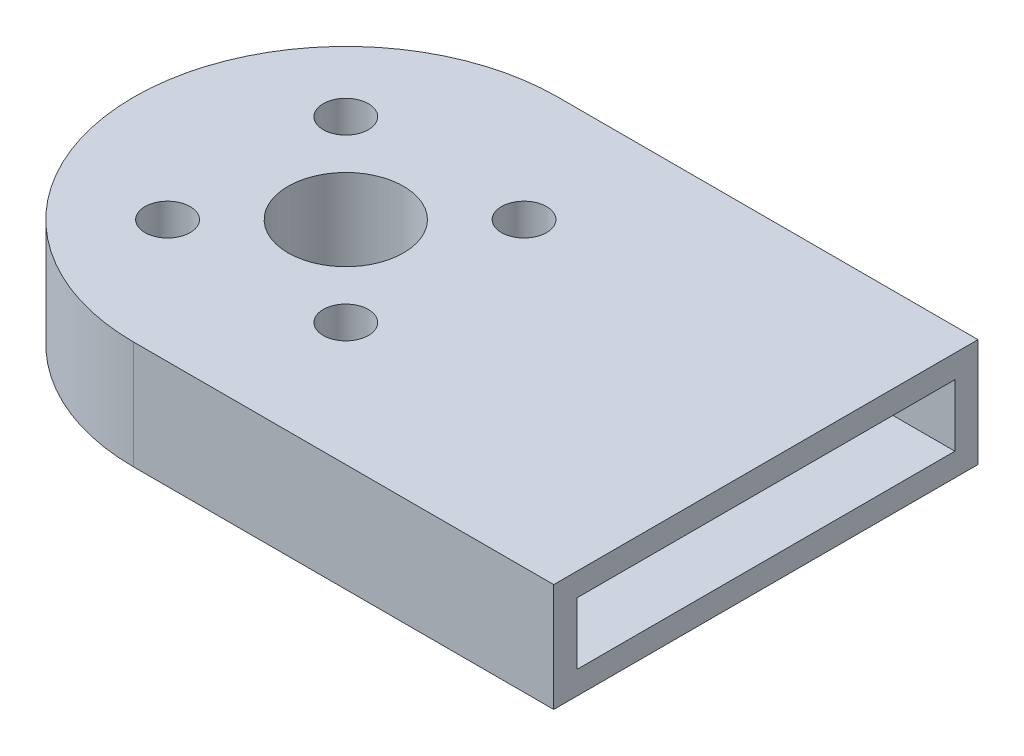
ISO-10303-21;
HEADER;
FILE_DESCRIPTION(('STEP AP214'),'2;1');
FILE_NAME('part.step','',(''),(''),'','','');
FILE_SCHEMA(('AUTOMOTIVE_DESIGN { 1 0 10303 214 1 1 1 1 }'));
ENDSEC;
DATA;
#1=APPLICATION_CONTEXT('core data for automotive mechanical design processes');
#2=APPLICATION_PROTOCOL_DEFINITION('international standard','automotive_design',2000,#1);
#3=PRODUCT_CONTEXT('',#1,'mechanical');
#4=PRODUCT('Part','Part','',(#3));
#5=PRODUCT_RELATED_PRODUCT_CATEGORY('part','',(#4));
#6=PRODUCT_DEFINITION_FORMATION('','',#4);
#7=PRODUCT_DEFINITION_CONTEXT('part definition',#1,'design');
#8=PRODUCT_DEFINITION('design','',#6,#7);
#9=PRODUCT_DEFINITION_SHAPE('','',#8);
#10=(LENGTH_UNIT() NAMED_UNIT(*) SI_UNIT(.MILLI.,.METRE.));
#11=(NAMED_UNIT(*) PLANE_ANGLE_UNIT() SI_UNIT($,.RADIAN.));
#12=(NAMED_UNIT(*) SI_UNIT($,.STERADIAN.) SOLID_ANGLE_UNIT());
#13=UNCERTAINTY_MEASURE_WITH_UNIT(LENGTH_MEASURE(1.E-05),#10,'distance_accuracy_value','');
#14=(GEOMETRIC_REPRESENTATION_CONTEXT(3) GLOBAL_UNCERTAINTY_ASSIGNED_CONTEXT((#13)) GLOBAL_UNIT_ASSIGNED_CONTEXT((#10,
#11,#12)) REPRESENTATION_CONTEXT('',''));
#15=CARTESIAN_POINT('',(0.,0.,0.));
#16=DIRECTION('',(0.,0.,1.));
#17=DIRECTION('',(1.,0.,0.));
#18=AXIS2_PLACEMENT_3D('',#15,#16,#17);
#19=CARTESIAN_POINT('',(20.,5.15,-10.1));
#20=DIRECTION('',(-1.,0.,0.));
#21=DIRECTION('',(0.,0.,1.));
#22=AXIS2_PLACEMENT_3D('',#19,#20,#21);
#23=PLANE('',#22);
#24=DIRECTION('',(0.,0.,-1.));
#25=VECTOR('',#24,1.);
#26=CARTESIAN_POINT('',(20.,0.,-10.1));
#27=LINE('',#26,#25);
#28=CARTESIAN_POINT('',(20.,0.,10.1));
#29=VERTEX_POINT('',#28);
#30=CARTESIAN_POINT('',(20.,0.,-10.1));
#31=VERTEX_POINT('',#30);
#32=EDGE_CURVE('E328',#29,#31,#27,.T.);
#33=ORIENTED_EDGE('',*,*,#32,.T.);
#34=DIRECTION('',(0.,-1.,0.));
#35=VECTOR('',#34,1.);
#36=CARTESIAN_POINT('',(20.,5.15,-10.1));
#37=LINE('',#36,#35);
#38=CARTESIAN_POINT('',(20.,5.15,-10.1));
#39=VERTEX_POINT('',#38);
#40=EDGE_CURVE('E335',#39,#31,#37,.T.);
#41=ORIENTED_EDGE('',*,*,#40,.F.);
#42=DIRECTION('',(0.,0.,-1.));
#43=VECTOR('',#42,1.);
#44=CARTESIAN_POINT('',(20.,5.15,-10.1));
#45=LINE('',#44,#43);
#46=CARTESIAN_POINT('',(20.,5.15,10.1));
#47=VERTEX_POINT('',#46);
#48=EDGE_CURVE('E316',#47,#39,#45,.T.);
#49=ORIENTED_EDGE('',*,*,#48,.F.);
#50=DIRECTION('',(0.,-1.,0.));
#51=VECTOR('',#50,1.);
#52=CARTESIAN_POINT('',(20.,5.15,10.1));
#53=LINE('',#52,#51);
#54=EDGE_CURVE('E54',#47,#29,#53,.T.);
#55=ORIENTED_EDGE('',*,*,#54,.T.);
#56=EDGE_LOOP('',(#33,#41,#49,#55));
#57=FACE_BOUND('',#56,.T.);
#58=DIRECTION('',(0.,0.,-1.));
#59=VECTOR('',#58,1.);
#60=CARTESIAN_POINT('',(20.,1.1,-10.1));
#61=LINE('',#60,#59);
#62=CARTESIAN_POINT('',(20.,1.1,9.));
#63=VERTEX_POINT('',#62);
#64=CARTESIAN_POINT('',(20.,1.1,-9.));
#65=VERTEX_POINT('',#64);
#66=EDGE_CURVE('E211',#63,#65,#61,.T.);
#67=ORIENTED_EDGE('',*,*,#66,.F.);
#68=DIRECTION('',(0.,-1.,0.));
#69=VECTOR('',#68,1.);
#70=CARTESIAN_POINT('',(20.,5.15,9.));
#71=LINE('',#70,#69);
#72=CARTESIAN_POINT('',(20.,4.05,9.));
#73=VERTEX_POINT('',#72);
#74=EDGE_CURVE('E194',#73,#63,#71,.T.);
#75=ORIENTED_EDGE('',*,*,#74,.F.);
#76=DIRECTION('',(0.,0.,-1.));
#77=VECTOR('',#76,1.);
#78=CARTESIAN_POINT('',(20.,4.05,-10.1));
#79=LINE('',#78,#77);
#80=CARTESIAN_POINT('',(20.,4.05,-9.));
#81=VERTEX_POINT('',#80);
#82=EDGE_CURVE('E61',#73,#81,#79,.T.);
#83=ORIENTED_EDGE('',*,*,#82,.T.);
#84=DIRECTION('',(0.,-1.,0.));
#85=VECTOR('',#84,1.);
#86=CARTESIAN_POINT('',(20.,5.15,-9.));
#87=LINE('',#86,#85);
#88=EDGE_CURVE('E200',#81,#65,#87,.T.);
#89=ORIENTED_EDGE('',*,*,#88,.T.);
#90=EDGE_LOOP('',(#67,#75,#83,#89));
#91=FACE_BOUND('',#90,.T.);
#92=ADVANCED_FACE('F45',(#57,#91),#23,.F.);
#93=CARTESIAN_POINT('',(0.,5.15,0.));
#94=DIRECTION('',(0.,1.,0.));
#95=DIRECTION('',(0.,0.,1.));
#96=AXIS2_PLACEMENT_3D('',#93,#94,#95);
#97=PLANE('',#96);
#98=CARTESIAN_POINT('',(4.2426406871193,5.15,4.24264068711927));
#99=DIRECTION('',(0.,1.,0.));
#100=DIRECTION('',(0.,0.,1.));
#101=AXIS2_PLACEMENT_3D('',#98,#99,#100);
#102=CIRCLE('',#101,1.075);
#103=CARTESIAN_POINT('',(4.2426406871193,5.15,5.31764068711928));
#104=VERTEX_POINT('',#103);
#105=EDGE_CURVE('E279',#104,#104,#102,.T.);
#106=ORIENTED_EDGE('',*,*,#105,.F.);
#107=EDGE_LOOP('',(#106));
#108=FACE_BOUND('',#107,.T.);
#109=CARTESIAN_POINT('',(4.24264068711929,5.15,-4.24264068711928));
#110=DIRECTION('',(0.,1.,0.));
#111=DIRECTION('',(0.,0.,1.));
#112=AXIS2_PLACEMENT_3D('',#109,#110,#111);
#113=CIRCLE('',#112,1.075);
#114=CARTESIAN_POINT('',(4.24264068711929,5.15,-3.16764068711928));
#115=VERTEX_POINT('',#114);
#116=EDGE_CURVE('E295',#115,#115,#113,.T.);
#117=ORIENTED_EDGE('',*,*,#116,.F.);
#118=EDGE_LOOP('',(#117));
#119=FACE_BOUND('',#118,.T.);
#120=CARTESIAN_POINT('',(0.,5.15,0.));
#121=DIRECTION('',(0.,1.,0.));
#122=DIRECTION('',(0.,0.,1.));
#123=AXIS2_PLACEMENT_3D('',#120,#121,#122);
#124=CIRCLE('',#123,10.1);
#125=CARTESIAN_POINT('',(0.,5.15,-10.1));
#126=VERTEX_POINT('',#125);
#127=CARTESIAN_POINT('',(0.,5.15,10.1));
#128=VERTEX_POINT('',#127);
#129=EDGE_CURVE('E311',#126,#128,#124,.T.);
#130=ORIENTED_EDGE('',*,*,#129,.T.);
#131=DIRECTION('',(1.,0.,0.));
#132=VECTOR('',#131,1.);
#133=CARTESIAN_POINT('',(20.,5.15,10.1));
#134=LINE('',#133,#132);
#135=EDGE_CURVE('E98',#128,#47,#134,.T.);
#136=ORIENTED_EDGE('',*,*,#135,.T.);
#137=ORIENTED_EDGE('',*,*,#48,.T.);
#138=DIRECTION('',(-1.,0.,0.));
#139=VECTOR('',#138,1.);
#140=CARTESIAN_POINT('',(0.,5.15,-10.1));
#141=LINE('',#140,#139);
#142=EDGE_CURVE('E70',#39,#126,#141,.T.);
#143=ORIENTED_EDGE('',*,*,#142,.T.);
#144=EDGE_LOOP('',(#130,#136,#137,#143));
#145=FACE_BOUND('',#144,.T.);
#146=CARTESIAN_POINT('',(-4.24264068711929,5.15,-4.24264068711928));
#147=DIRECTION('',(0.,1.,0.));
#148=DIRECTION('',(0.,0.,1.));
#149=AXIS2_PLACEMENT_3D('',#146,#147,#148);
#150=CIRCLE('',#149,1.075);
#151=CARTESIAN_POINT('',(-4.24264068711929,5.15,-3.16764068711928));
#152=VERTEX_POINT('',#151);
#153=EDGE_CURVE('E303',#152,#152,#150,.T.);
#154=ORIENTED_EDGE('',*,*,#153,.F.);
#155=EDGE_LOOP('',(#154));
#156=FACE_BOUND('',#155,.T.);
#157=CARTESIAN_POINT('',(-4.24264068711929,5.15,4.24264068711928));
#158=DIRECTION('',(0.,1.,0.));
#159=DIRECTION('',(0.,0.,1.));
#160=AXIS2_PLACEMENT_3D('',#157,#158,#159);
#161=CIRCLE('',#160,1.075);
#162=CARTESIAN_POINT('',(-4.24264068711929,5.15,5.31764068711928));
#163=VERTEX_POINT('',#162);
#164=EDGE_CURVE('E287',#163,#163,#161,.T.);
#165=ORIENTED_EDGE('',*,*,#164,.F.);
#166=EDGE_LOOP('',(#165));
#167=FACE_BOUND('',#166,.T.);
#168=CARTESIAN_POINT('',(0.,5.15,0.));
#169=DIRECTION('',(0.,1.,0.));
#170=DIRECTION('',(0.,0.,1.));
#171=AXIS2_PLACEMENT_3D('',#168,#169,#170);
#172=CIRCLE('',#171,2.75);
#173=CARTESIAN_POINT('',(0.,5.15,2.75));
#174=VERTEX_POINT('',#173);
#175=EDGE_CURVE('E271',#174,#174,#172,.T.);
#176=ORIENTED_EDGE('',*,*,#175,.F.);
#177=EDGE_LOOP('',(#176));
#178=FACE_BOUND('',#177,.T.);
#179=ADVANCED_FACE('F366',(#108,#119,#145,#156,#167,#178),#97,.T.);
#180=CARTESIAN_POINT('',(0.,0.,0.));
#181=DIRECTION('',(0.,1.,0.));
#182=DIRECTION('',(0.,0.,1.));
#183=AXIS2_PLACEMENT_3D('',#180,#181,#182);
#184=PLANE('',#183);
#185=CARTESIAN_POINT('',(0.,0.,0.));
#186=DIRECTION('',(0.,1.,0.));
#187=DIRECTION('',(0.,0.,1.));
#188=AXIS2_PLACEMENT_3D('',#185,#186,#187);
#189=CIRCLE('',#188,10.1);
#190=CARTESIAN_POINT('',(0.,0.,-10.1));
#191=VERTEX_POINT('',#190);
#192=CARTESIAN_POINT('',(0.,0.,10.1));
#193=VERTEX_POINT('',#192);
#194=EDGE_CURVE('E307',#191,#193,#189,.T.);
#195=ORIENTED_EDGE('',*,*,#194,.F.);
#196=DIRECTION('',(-1.,0.,0.));
#197=VECTOR('',#196,1.);
#198=CARTESIAN_POINT('',(0.,0.,-10.1));
#199=LINE('',#198,#197);
#200=EDGE_CURVE('E91',#31,#191,#199,.T.);
#201=ORIENTED_EDGE('',*,*,#200,.F.);
#202=ORIENTED_EDGE('',*,*,#32,.F.);
#203=DIRECTION('',(1.,0.,0.));
#204=VECTOR('',#203,1.);
#205=CARTESIAN_POINT('',(20.,0.,10.1));
#206=LINE('',#205,#204);
#207=EDGE_CURVE('E325',#193,#29,#206,.T.);
#208=ORIENTED_EDGE('',*,*,#207,.F.);
#209=EDGE_LOOP('',(#195,#201,#202,#208));
#210=FACE_BOUND('',#209,.T.);
#211=CARTESIAN_POINT('',(-4.24264068711929,0.,-4.24264068711928));
#212=DIRECTION('',(0.,1.,0.));
#213=DIRECTION('',(0.,0.,1.));
#214=AXIS2_PLACEMENT_3D('',#211,#212,#213);
#215=CIRCLE('',#214,1.075);
#216=CARTESIAN_POINT('',(-4.24264068711929,0.,-3.16764068711928));
#217=VERTEX_POINT('',#216);
#218=EDGE_CURVE('E299',#217,#217,#215,.T.);
#219=ORIENTED_EDGE('',*,*,#218,.T.);
#220=EDGE_LOOP('',(#219));
#221=FACE_BOUND('',#220,.T.);
#222=CARTESIAN_POINT('',(4.24264068711929,0.,-4.24264068711928));
#223=DIRECTION('',(0.,1.,0.));
#224=DIRECTION('',(0.,0.,1.));
#225=AXIS2_PLACEMENT_3D('',#222,#223,#224);
#226=CIRCLE('',#225,1.075);
#227=CARTESIAN_POINT('',(4.24264068711929,0.,-3.16764068711928));
#228=VERTEX_POINT('',#227);
#229=EDGE_CURVE('E291',#228,#228,#226,.T.);
#230=ORIENTED_EDGE('',*,*,#229,.T.);
#231=EDGE_LOOP('',(#230));
#232=FACE_BOUND('',#231,.T.);
#233=CARTESIAN_POINT('',(-4.24264068711929,0.,4.24264068711928));
#234=DIRECTION('',(0.,1.,0.));
#235=DIRECTION('',(0.,0.,1.));
#236=AXIS2_PLACEMENT_3D('',#233,#234,#235);
#237=CIRCLE('',#236,1.075);
#238=CARTESIAN_POINT('',(-4.24264068711929,0.,5.31764068711928));
#239=VERTEX_POINT('',#238);
#240=EDGE_CURVE('E283',#239,#239,#237,.T.);
#241=ORIENTED_EDGE('',*,*,#240,.T.);
#242=EDGE_LOOP('',(#241));
#243=FACE_BOUND('',#242,.T.);
#244=CARTESIAN_POINT('',(4.2426406871193,0.,4.24264068711927));
#245=DIRECTION('',(0.,1.,0.));
#246=DIRECTION('',(0.,0.,1.));
#247=AXIS2_PLACEMENT_3D('',#244,#245,#246);
#248=CIRCLE('',#247,1.075);
#249=CARTESIAN_POINT('',(4.2426406871193,0.,5.31764068711928));
#250=VERTEX_POINT('',#249);
#251=EDGE_CURVE('E275',#250,#250,#248,.T.);
#252=ORIENTED_EDGE('',*,*,#251,.T.);
#253=EDGE_LOOP('',(#252));
#254=FACE_BOUND('',#253,.T.);
#255=CARTESIAN_POINT('',(0.,0.,0.));
#256=DIRECTION('',(0.,1.,0.));
#257=DIRECTION('',(0.,0.,1.));
#258=AXIS2_PLACEMENT_3D('',#255,#256,#257);
#259=CIRCLE('',#258,2.75);
#260=CARTESIAN_POINT('',(0.,0.,2.75));
#261=VERTEX_POINT('',#260);
#262=EDGE_CURVE('E270',#261,#261,#259,.T.);
#263=ORIENTED_EDGE('',*,*,#262,.T.);
#264=EDGE_LOOP('',(#263));
#265=FACE_BOUND('',#264,.T.);
#266=ADVANCED_FACE('F346',(#210,#221,#232,#243,#254,#265),#184,.F.);
#267=CARTESIAN_POINT('',(0.,5.15,0.));
#268=DIRECTION('',(0.,-1.,0.));
#269=DIRECTION('',(0.,0.,-1.));
#270=AXIS2_PLACEMENT_3D('',#267,#268,#269);
#271=CYLINDRICAL_SURFACE('',#270,10.1);
#272=ORIENTED_EDGE('',*,*,#194,.T.);
#273=DIRECTION('',(0.,-1.,0.));
#274=VECTOR('',#273,1.);
#275=CARTESIAN_POINT('',(0.,5.15,10.1));
#276=LINE('',#275,#274);
#277=EDGE_CURVE('E11',#128,#193,#276,.T.);
#278=ORIENTED_EDGE('',*,*,#277,.F.);
#279=ORIENTED_EDGE('',*,*,#129,.F.);
#280=DIRECTION('',(0.,-1.,0.));
#281=VECTOR('',#280,1.);
#282=CARTESIAN_POINT('',(0.,5.15,-10.1));
#283=LINE('',#282,#281);
#284=EDGE_CURVE('E321',#126,#191,#283,.T.);
#285=ORIENTED_EDGE('',*,*,#284,.T.);
#286=EDGE_LOOP('',(#272,#278,#279,#285));
#287=FACE_BOUND('',#286,.T.);
#288=ADVANCED_FACE('F47',(#287),#271,.T.);
#289=CARTESIAN_POINT('',(20.,5.15,10.1));
#290=DIRECTION('',(0.,0.,-1.));
#291=DIRECTION('',(-1.,0.,0.));
#292=AXIS2_PLACEMENT_3D('',#289,#290,#291);
#293=PLANE('',#292);
#294=ORIENTED_EDGE('',*,*,#207,.T.);
#295=ORIENTED_EDGE('',*,*,#54,.F.);
#296=ORIENTED_EDGE('',*,*,#135,.F.);
#297=ORIENTED_EDGE('',*,*,#277,.T.);
#298=EDGE_LOOP('',(#294,#295,#296,#297));
#299=FACE_BOUND('',#298,.T.);
#300=ADVANCED_FACE('F354',(#299),#293,.F.);
#301=CARTESIAN_POINT('',(0.,5.15,-10.1));
#302=DIRECTION('',(0.,0.,1.));
#303=DIRECTION('',(1.,0.,0.));
#304=AXIS2_PLACEMENT_3D('',#301,#302,#303);
#305=PLANE('',#304);
#306=ORIENTED_EDGE('',*,*,#200,.T.);
#307=ORIENTED_EDGE('',*,*,#284,.F.);
#308=ORIENTED_EDGE('',*,*,#142,.F.);
#309=ORIENTED_EDGE('',*,*,#40,.T.);
#310=EDGE_LOOP('',(#306,#307,#308,#309));
#311=FACE_BOUND('',#310,.T.);
#312=ADVANCED_FACE('F351',(#311),#305,.F.);
#313=CARTESIAN_POINT('',(-4.24264068711929,5.15,-4.24264068711928));
#314=DIRECTION('',(0.,-1.,0.));
#315=DIRECTION('',(0.,0.,-1.));
#316=AXIS2_PLACEMENT_3D('',#313,#314,#315);
#317=CYLINDRICAL_SURFACE('',#316,1.075);
#318=ORIENTED_EDGE('',*,*,#153,.T.);
#319=EDGE_LOOP('',(#318));
#320=FACE_BOUND('',#319,.T.);
#321=ORIENTED_EDGE('',*,*,#218,.F.);
#322=EDGE_LOOP('',(#321));
#323=FACE_BOUND('',#322,.T.);
#324=ADVANCED_FACE('F353',(#320,#323),#317,.F.);
#325=CARTESIAN_POINT('',(4.24264068711929,5.15,-4.24264068711928));
#326=DIRECTION('',(0.,-1.,0.));
#327=DIRECTION('',(0.,0.,-1.));
#328=AXIS2_PLACEMENT_3D('',#325,#326,#327);
#329=CYLINDRICAL_SURFACE('',#328,1.075);
#330=ORIENTED_EDGE('',*,*,#116,.T.);
#331=EDGE_LOOP('',(#330));
#332=FACE_BOUND('',#331,.T.);
#333=ORIENTED_EDGE('',*,*,#229,.F.);
#334=EDGE_LOOP('',(#333));
#335=FACE_BOUND('',#334,.T.);
#336=ADVANCED_FACE('F360',(#332,#335),#329,.F.);
#337=CARTESIAN_POINT('',(-4.24264068711929,5.15,4.24264068711928));
#338=DIRECTION('',(0.,-1.,0.));
#339=DIRECTION('',(0.,0.,-1.));
#340=AXIS2_PLACEMENT_3D('',#337,#338,#339);
#341=CYLINDRICAL_SURFACE('',#340,1.075);
#342=ORIENTED_EDGE('',*,*,#164,.T.);
#343=EDGE_LOOP('',(#342));
#344=FACE_BOUND('',#343,.T.);
#345=ORIENTED_EDGE('',*,*,#240,.F.);
#346=EDGE_LOOP('',(#345));
#347=FACE_BOUND('',#346,.T.);
#348=ADVANCED_FACE('F382',(#344,#347),#341,.F.);
#349=CARTESIAN_POINT('',(4.2426406871193,5.15,4.24264068711927));
#350=DIRECTION('',(0.,-1.,0.));
#351=DIRECTION('',(0.,0.,-1.));
#352=AXIS2_PLACEMENT_3D('',#349,#350,#351);
#353=CYLINDRICAL_SURFACE('',#352,1.075);
#354=ORIENTED_EDGE('',*,*,#105,.T.);
#355=EDGE_LOOP('',(#354));
#356=FACE_BOUND('',#355,.T.);
#357=ORIENTED_EDGE('',*,*,#251,.F.);
#358=EDGE_LOOP('',(#357));
#359=FACE_BOUND('',#358,.T.);
#360=ADVANCED_FACE('F386',(#356,#359),#353,.F.);
#361=CARTESIAN_POINT('',(0.,5.15,0.));
#362=DIRECTION('',(0.,-1.,0.));
#363=DIRECTION('',(0.,0.,-1.));
#364=AXIS2_PLACEMENT_3D('',#361,#362,#363);
#365=CYLINDRICAL_SURFACE('',#364,2.75);
#366=ORIENTED_EDGE('',*,*,#175,.T.);
#367=EDGE_LOOP('',(#366));
#368=FACE_BOUND('',#367,.T.);
#369=ORIENTED_EDGE('',*,*,#262,.F.);
#370=EDGE_LOOP('',(#369));
#371=FACE_BOUND('',#370,.T.);
#372=ADVANCED_FACE('F390',(#368,#371),#365,.F.);
#373=CARTESIAN_POINT('',(0.,5.15,0.));
#374=DIRECTION('',(0.,-1.,0.));
#375=DIRECTION('',(0.,0.,-1.));
#376=AXIS2_PLACEMENT_3D('',#373,#374,#375);
#377=CYLINDRICAL_SURFACE('',#376,3.85);
#378=CARTESIAN_POINT('',(0.,1.1,0.));
#379=DIRECTION('',(0.,1.,0.));
#380=DIRECTION('',(0.,0.,1.));
#381=AXIS2_PLACEMENT_3D('',#378,#379,#380);
#382=CIRCLE('',#381,3.85);
#383=CARTESIAN_POINT('',(-2.90213357032308,1.1,-2.5298459913607));
#384=VERTEX_POINT('',#383);
#385=CARTESIAN_POINT('',(-2.90213357032309,1.1,2.52984599136069));
#386=VERTEX_POINT('',#385);
#387=EDGE_CURVE('E235',#384,#386,#382,.T.);
#388=ORIENTED_EDGE('',*,*,#387,.T.);
#389=DIRECTION('',(0.,1.,0.));
#390=VECTOR('',#389,1.);
#391=CARTESIAN_POINT('',(-2.90213357032309,5.15,2.52984599136069));
#392=LINE('',#391,#390);
#393=CARTESIAN_POINT('',(-2.90213357032309,4.05,2.52984599136069));
#394=VERTEX_POINT('',#393);
#395=EDGE_CURVE('E252',#386,#394,#392,.T.);
#396=ORIENTED_EDGE('',*,*,#395,.T.);
#397=CARTESIAN_POINT('',(0.,4.05,0.));
#398=DIRECTION('',(0.,1.,0.));
#399=DIRECTION('',(0.,0.,1.));
#400=AXIS2_PLACEMENT_3D('',#397,#398,#399);
#401=CIRCLE('',#400,3.85);
#402=CARTESIAN_POINT('',(-2.90213357032308,4.05,-2.5298459913607));
#403=VERTEX_POINT('',#402);
#404=EDGE_CURVE('E467',#403,#394,#401,.T.);
#405=ORIENTED_EDGE('',*,*,#404,.F.);
#406=DIRECTION('',(0.,1.,0.));
#407=VECTOR('',#406,1.);
#408=CARTESIAN_POINT('',(-2.90213357032308,5.15,-2.52984599136071));
#409=LINE('',#408,#407);
#410=EDGE_CURVE('E267',#384,#403,#409,.T.);
#411=ORIENTED_EDGE('',*,*,#410,.F.);
#412=EDGE_LOOP('',(#388,#396,#405,#411));
#413=FACE_BOUND('',#412,.T.);
#414=ADVANCED_FACE('F393',(#413),#377,.T.);
#415=DIRECTION('',(0.,1.,0.));
#416=VECTOR('',#415,1.);
#417=CARTESIAN_POINT('',(-2.52984599136072,5.15,-2.90213357032307));
#418=LINE('',#417,#416);
#419=CARTESIAN_POINT('',(-2.52984599136072,1.1,-2.90213357032307));
#420=VERTEX_POINT('',#419);
#421=CARTESIAN_POINT('',(-2.52984599136072,4.05,-2.90213357032307));
#422=VERTEX_POINT('',#421);
#423=EDGE_CURVE('E264',#420,#422,#418,.T.);
#424=ORIENTED_EDGE('',*,*,#423,.T.);
#425=CARTESIAN_POINT('',(2.5298459913607,4.05,-2.90213357032308));
#426=VERTEX_POINT('',#425);
#427=EDGE_CURVE('E469',#426,#422,#401,.T.);
#428=ORIENTED_EDGE('',*,*,#427,.F.);
#429=DIRECTION('',(0.,1.,0.));
#430=VECTOR('',#429,1.);
#431=CARTESIAN_POINT('',(2.5298459913607,5.15,-2.90213357032308));
#432=LINE('',#431,#430);
#433=CARTESIAN_POINT('',(2.5298459913607,1.1,-2.90213357032308));
#434=VERTEX_POINT('',#433);
#435=EDGE_CURVE('E261',#434,#426,#432,.T.);
#436=ORIENTED_EDGE('',*,*,#435,.F.);
#437=EDGE_CURVE('E242',#434,#420,#382,.T.);
#438=ORIENTED_EDGE('',*,*,#437,.T.);
#439=EDGE_LOOP('',(#424,#428,#436,#438));
#440=FACE_BOUND('',#439,.T.);
#441=ADVANCED_FACE('F432',(#440),#377,.T.);
#442=CARTESIAN_POINT('',(-2.5298459913607,1.1,2.90213357032308));
#443=VERTEX_POINT('',#442);
#444=CARTESIAN_POINT('',(2.52984599136072,1.1,2.90213357032306));
#445=VERTEX_POINT('',#444);
#446=EDGE_CURVE('E240',#443,#445,#382,.T.);
#447=ORIENTED_EDGE('',*,*,#446,.T.);
#448=DIRECTION('',(0.,1.,0.));
#449=VECTOR('',#448,1.);
#450=CARTESIAN_POINT('',(2.52984599136072,5.15,2.90213357032306));
#451=LINE('',#450,#449);
#452=CARTESIAN_POINT('',(2.52984599136072,4.05,2.90213357032306));
#453=VERTEX_POINT('',#452);
#454=EDGE_CURVE('E193',#445,#453,#451,.T.);
#455=ORIENTED_EDGE('',*,*,#454,.T.);
#456=CARTESIAN_POINT('',(-2.5298459913607,4.05,2.90213357032308));
#457=VERTEX_POINT('',#456);
#458=EDGE_CURVE('E234',#457,#453,#401,.T.);
#459=ORIENTED_EDGE('',*,*,#458,.F.);
#460=DIRECTION('',(0.,1.,0.));
#461=VECTOR('',#460,1.);
#462=CARTESIAN_POINT('',(-2.5298459913607,5.15,2.90213357032308));
#463=LINE('',#462,#461);
#464=EDGE_CURVE('E255',#443,#457,#463,.T.);
#465=ORIENTED_EDGE('',*,*,#464,.F.);
#466=EDGE_LOOP('',(#447,#455,#459,#465));
#467=FACE_BOUND('',#466,.T.);
#468=ADVANCED_FACE('F400',(#467),#377,.T.);
#469=CARTESIAN_POINT('',(0.,4.05,0.));
#470=DIRECTION('',(0.,1.,0.));
#471=DIRECTION('',(0.,0.,1.));
#472=AXIS2_PLACEMENT_3D('',#469,#470,#471);
#473=PLANE('',#472);
#474=CARTESIAN_POINT('',(0.,4.05,0.));
#475=DIRECTION('',(0.,1.,0.));
#476=DIRECTION('',(0.,0.,1.));
#477=AXIS2_PLACEMENT_3D('',#474,#475,#476);
#478=CIRCLE('',#477,9.);
#479=CARTESIAN_POINT('',(0.,4.05,-9.));
#480=VERTEX_POINT('',#479);
#481=CARTESIAN_POINT('',(0.,4.05,9.));
#482=VERTEX_POINT('',#481);
#483=EDGE_CURVE('E171',#480,#482,#478,.T.);
#484=ORIENTED_EDGE('',*,*,#483,.F.);
#485=DIRECTION('',(-1.,0.,0.));
#486=VECTOR('',#485,1.);
#487=CARTESIAN_POINT('',(0.,4.05,-9.));
#488=LINE('',#487,#486);
#489=EDGE_CURVE('E208',#81,#480,#488,.T.);
#490=ORIENTED_EDGE('',*,*,#489,.F.);
#491=ORIENTED_EDGE('',*,*,#82,.F.);
#492=DIRECTION('',(1.,0.,0.));
#493=VECTOR('',#492,1.);
#494=CARTESIAN_POINT('',(20.,4.05,9.));
#495=LINE('',#494,#493);
#496=EDGE_CURVE('E167',#482,#73,#495,.T.);
#497=ORIENTED_EDGE('',*,*,#496,.F.);
#498=EDGE_LOOP('',(#484,#490,#491,#497));
#499=FACE_BOUND('',#498,.T.);
#500=CARTESIAN_POINT('',(4.2426406871193,4.05,4.24264068711927));
#501=DIRECTION('',(0.,1.,0.));
#502=DIRECTION('',(0.,0.,1.));
#503=AXIS2_PLACEMENT_3D('',#500,#501,#502);
#504=CIRCLE('',#503,2.175);
#505=CARTESIAN_POINT('',(2.90213357032308,4.05,2.52984599136071));
#506=VERTEX_POINT('',#505);
#507=EDGE_CURVE('E229',#453,#506,#504,.T.);
#508=ORIENTED_EDGE('',*,*,#507,.T.);
#509=CARTESIAN_POINT('',(2.90213357032309,4.05,-2.52984599136069));
#510=VERTEX_POINT('',#509);
#511=EDGE_CURVE('E239',#506,#510,#401,.T.);
#512=ORIENTED_EDGE('',*,*,#511,.T.);
#513=CARTESIAN_POINT('',(4.24264068711929,4.05,-4.24264068711928));
#514=DIRECTION('',(0.,1.,0.));
#515=DIRECTION('',(0.,0.,1.));
#516=AXIS2_PLACEMENT_3D('',#513,#514,#515);
#517=CIRCLE('',#516,2.175);
#518=EDGE_CURVE('E219',#510,#426,#517,.T.);
#519=ORIENTED_EDGE('',*,*,#518,.T.);
#520=ORIENTED_EDGE('',*,*,#427,.T.);
#521=CARTESIAN_POINT('',(-4.24264068711929,4.05,-4.24264068711928));
#522=DIRECTION('',(0.,1.,0.));
#523=DIRECTION('',(0.,0.,1.));
#524=AXIS2_PLACEMENT_3D('',#521,#522,#523);
#525=CIRCLE('',#524,2.175);
#526=EDGE_CURVE('E218',#422,#403,#525,.T.);
#527=ORIENTED_EDGE('',*,*,#526,.T.);
#528=ORIENTED_EDGE('',*,*,#404,.T.);
#529=CARTESIAN_POINT('',(-4.24264068711929,4.05,4.24264068711928));
#530=DIRECTION('',(0.,1.,0.));
#531=DIRECTION('',(0.,0.,1.));
#532=AXIS2_PLACEMENT_3D('',#529,#530,#531);
#533=CIRCLE('',#532,2.175);
#534=EDGE_CURVE('E224',#394,#457,#533,.T.);
#535=ORIENTED_EDGE('',*,*,#534,.T.);
#536=ORIENTED_EDGE('',*,*,#458,.T.);
#537=EDGE_LOOP('',(#508,#512,#519,#520,#527,#528,#535,#536));
#538=FACE_BOUND('',#537,.T.);
#539=ADVANCED_FACE('F169',(#499,#538),#473,.F.);
#540=CARTESIAN_POINT('',(0.,1.1,0.));
#541=DIRECTION('',(0.,1.,0.));
#542=DIRECTION('',(0.,0.,1.));
#543=AXIS2_PLACEMENT_3D('',#540,#541,#542);
#544=PLANE('',#543);
#545=CARTESIAN_POINT('',(0.,1.1,0.));
#546=DIRECTION('',(0.,1.,0.));
#547=DIRECTION('',(0.,0.,1.));
#548=AXIS2_PLACEMENT_3D('',#545,#546,#547);
#549=CIRCLE('',#548,9.);
#550=CARTESIAN_POINT('',(0.,1.1,-9.));
#551=VERTEX_POINT('',#550);
#552=CARTESIAN_POINT('',(0.,1.1,9.));
#553=VERTEX_POINT('',#552);
#554=EDGE_CURVE('E204',#551,#553,#549,.T.);
#555=ORIENTED_EDGE('',*,*,#554,.T.);
#556=DIRECTION('',(1.,0.,0.));
#557=VECTOR('',#556,1.);
#558=CARTESIAN_POINT('',(20.,1.1,9.));
#559=LINE('',#558,#557);
#560=EDGE_CURVE('E191',#553,#63,#559,.T.);
#561=ORIENTED_EDGE('',*,*,#560,.T.);
#562=ORIENTED_EDGE('',*,*,#66,.T.);
#563=DIRECTION('',(-1.,0.,0.));
#564=VECTOR('',#563,1.);
#565=CARTESIAN_POINT('',(0.,1.1,-9.));
#566=LINE('',#565,#564);
#567=EDGE_CURVE('E188',#65,#551,#566,.T.);
#568=ORIENTED_EDGE('',*,*,#567,.T.);
#569=EDGE_LOOP('',(#555,#561,#562,#568));
#570=FACE_BOUND('',#569,.T.);
#571=ORIENTED_EDGE('',*,*,#446,.F.);
#572=CARTESIAN_POINT('',(-4.24264068711929,1.1,4.24264068711928));
#573=DIRECTION('',(0.,1.,0.));
#574=DIRECTION('',(0.,0.,1.));
#575=AXIS2_PLACEMENT_3D('',#572,#573,#574);
#576=CIRCLE('',#575,2.175);
#577=EDGE_CURVE('E225',#386,#443,#576,.T.);
#578=ORIENTED_EDGE('',*,*,#577,.F.);
#579=ORIENTED_EDGE('',*,*,#387,.F.);
#580=CARTESIAN_POINT('',(-4.24264068711929,1.1,-4.24264068711928));
#581=DIRECTION('',(0.,1.,0.));
#582=DIRECTION('',(0.,0.,1.));
#583=AXIS2_PLACEMENT_3D('',#580,#581,#582);
#584=CIRCLE('',#583,2.175);
#585=EDGE_CURVE('E214',#420,#384,#584,.T.);
#586=ORIENTED_EDGE('',*,*,#585,.F.);
#587=ORIENTED_EDGE('',*,*,#437,.F.);
#588=CARTESIAN_POINT('',(4.24264068711929,1.1,-4.24264068711928));
#589=DIRECTION('',(0.,1.,0.));
#590=DIRECTION('',(0.,0.,1.));
#591=AXIS2_PLACEMENT_3D('',#588,#589,#590);
#592=CIRCLE('',#591,2.175);
#593=CARTESIAN_POINT('',(2.90213357032309,1.1,-2.52984599136069));
#594=VERTEX_POINT('',#593);
#595=EDGE_CURVE('E220',#594,#434,#592,.T.);
#596=ORIENTED_EDGE('',*,*,#595,.F.);
#597=CARTESIAN_POINT('',(2.90213357032308,1.1,2.52984599136071));
#598=VERTEX_POINT('',#597);
#599=EDGE_CURVE('E241',#598,#594,#382,.T.);
#600=ORIENTED_EDGE('',*,*,#599,.F.);
#601=CARTESIAN_POINT('',(4.2426406871193,1.1,4.24264068711927));
#602=DIRECTION('',(0.,1.,0.));
#603=DIRECTION('',(0.,0.,1.));
#604=AXIS2_PLACEMENT_3D('',#601,#602,#603);
#605=CIRCLE('',#604,2.175);
#606=EDGE_CURVE('E230',#445,#598,#605,.T.);
#607=ORIENTED_EDGE('',*,*,#606,.F.);
#608=EDGE_LOOP('',(#571,#578,#579,#586,#587,#596,#600,#607));
#609=FACE_BOUND('',#608,.T.);
#610=ADVANCED_FACE('F424',(#570,#609),#544,.T.);
#611=CARTESIAN_POINT('',(0.,5.15,0.));
#612=DIRECTION('',(0.,-1.,0.));
#613=DIRECTION('',(0.,0.,-1.));
#614=AXIS2_PLACEMENT_3D('',#611,#612,#613);
#615=CYLINDRICAL_SURFACE('',#614,9.);
#616=ORIENTED_EDGE('',*,*,#554,.F.);
#617=DIRECTION('',(0.,-1.,0.));
#618=VECTOR('',#617,1.);
#619=CARTESIAN_POINT('',(0.,5.15,-9.));
#620=LINE('',#619,#618);
#621=EDGE_CURVE('E186',#480,#551,#620,.T.);
#622=ORIENTED_EDGE('',*,*,#621,.F.);
#623=ORIENTED_EDGE('',*,*,#483,.T.);
#624=DIRECTION('',(0.,1.,0.));
#625=VECTOR('',#624,1.);
#626=CARTESIAN_POINT('',(0.,5.15,9.));
#627=LINE('',#626,#625);
#628=EDGE_CURVE('E183',#482,#553,#627,.F.);
#629=ORIENTED_EDGE('',*,*,#628,.T.);
#630=EDGE_LOOP('',(#616,#622,#623,#629));
#631=FACE_BOUND('',#630,.T.);
#632=ADVANCED_FACE('F182',(#631),#615,.F.);
#633=CARTESIAN_POINT('',(20.,5.15,9.));
#634=DIRECTION('',(0.,0.,-1.));
#635=DIRECTION('',(-1.,0.,0.));
#636=AXIS2_PLACEMENT_3D('',#633,#634,#635);
#637=PLANE('',#636);
#638=ORIENTED_EDGE('',*,*,#560,.F.);
#639=ORIENTED_EDGE('',*,*,#628,.F.);
#640=ORIENTED_EDGE('',*,*,#496,.T.);
#641=ORIENTED_EDGE('',*,*,#74,.T.);
#642=EDGE_LOOP('',(#638,#639,#640,#641));
#643=FACE_BOUND('',#642,.T.);
#644=ADVANCED_FACE('F190',(#643),#637,.T.);
#645=CARTESIAN_POINT('',(0.,5.15,-9.));
#646=DIRECTION('',(0.,0.,1.));
#647=DIRECTION('',(1.,0.,0.));
#648=AXIS2_PLACEMENT_3D('',#645,#646,#647);
#649=PLANE('',#648);
#650=ORIENTED_EDGE('',*,*,#567,.F.);
#651=ORIENTED_EDGE('',*,*,#88,.F.);
#652=ORIENTED_EDGE('',*,*,#489,.T.);
#653=ORIENTED_EDGE('',*,*,#621,.T.);
#654=EDGE_LOOP('',(#650,#651,#652,#653));
#655=FACE_BOUND('',#654,.T.);
#656=ADVANCED_FACE('F415',(#655),#649,.T.);
#657=CARTESIAN_POINT('',(-4.24264068711929,5.15,-4.24264068711928));
#658=DIRECTION('',(0.,-1.,0.));
#659=DIRECTION('',(0.,0.,-1.));
#660=AXIS2_PLACEMENT_3D('',#657,#658,#659);
#661=CYLINDRICAL_SURFACE('',#660,2.175);
#662=ORIENTED_EDGE('',*,*,#410,.T.);
#663=ORIENTED_EDGE('',*,*,#526,.F.);
#664=ORIENTED_EDGE('',*,*,#423,.F.);
#665=ORIENTED_EDGE('',*,*,#585,.T.);
#666=EDGE_LOOP('',(#662,#663,#664,#665));
#667=FACE_BOUND('',#666,.T.);
#668=ADVANCED_FACE('F411',(#667),#661,.T.);
#669=CARTESIAN_POINT('',(4.24264068711929,5.15,-4.24264068711928));
#670=DIRECTION('',(0.,-1.,0.));
#671=DIRECTION('',(0.,0.,-1.));
#672=AXIS2_PLACEMENT_3D('',#669,#670,#671);
#673=CYLINDRICAL_SURFACE('',#672,2.175);
#674=ORIENTED_EDGE('',*,*,#435,.T.);
#675=ORIENTED_EDGE('',*,*,#518,.F.);
#676=DIRECTION('',(0.,1.,0.));
#677=VECTOR('',#676,1.);
#678=CARTESIAN_POINT('',(2.90213357032309,5.15,-2.52984599136069));
#679=LINE('',#678,#677);
#680=EDGE_CURVE('E258',#594,#510,#679,.T.);
#681=ORIENTED_EDGE('',*,*,#680,.F.);
#682=ORIENTED_EDGE('',*,*,#595,.T.);
#683=EDGE_LOOP('',(#674,#675,#681,#682));
#684=FACE_BOUND('',#683,.T.);
#685=ADVANCED_FACE('F407',(#684),#673,.T.);
#686=CARTESIAN_POINT('',(-4.24264068711929,5.15,4.24264068711928));
#687=DIRECTION('',(0.,-1.,0.));
#688=DIRECTION('',(0.,0.,-1.));
#689=AXIS2_PLACEMENT_3D('',#686,#687,#688);
#690=CYLINDRICAL_SURFACE('',#689,2.175);
#691=ORIENTED_EDGE('',*,*,#464,.T.);
#692=ORIENTED_EDGE('',*,*,#534,.F.);
#693=ORIENTED_EDGE('',*,*,#395,.F.);
#694=ORIENTED_EDGE('',*,*,#577,.T.);
#695=EDGE_LOOP('',(#691,#692,#693,#694));
#696=FACE_BOUND('',#695,.T.);
#697=ADVANCED_FACE('F403',(#696),#690,.T.);
#698=CARTESIAN_POINT('',(4.2426406871193,5.15,4.24264068711927));
#699=DIRECTION('',(0.,-1.,0.));
#700=DIRECTION('',(0.,0.,-1.));
#701=AXIS2_PLACEMENT_3D('',#698,#699,#700);
#702=CYLINDRICAL_SURFACE('',#701,2.175);
#703=DIRECTION('',(0.,1.,0.));
#704=VECTOR('',#703,1.);
#705=CARTESIAN_POINT('',(2.90213357032308,5.15,2.52984599136071));
#706=LINE('',#705,#704);
#707=EDGE_CURVE('E198',#598,#506,#706,.T.);
#708=ORIENTED_EDGE('',*,*,#707,.T.);
#709=ORIENTED_EDGE('',*,*,#507,.F.);
#710=ORIENTED_EDGE('',*,*,#454,.F.);
#711=ORIENTED_EDGE('',*,*,#606,.T.);
#712=EDGE_LOOP('',(#708,#709,#710,#711));
#713=FACE_BOUND('',#712,.T.);
#714=ADVANCED_FACE('F398',(#713),#702,.T.);
#715=ORIENTED_EDGE('',*,*,#680,.T.);
#716=ORIENTED_EDGE('',*,*,#511,.F.);
#717=ORIENTED_EDGE('',*,*,#707,.F.);
#718=ORIENTED_EDGE('',*,*,#599,.T.);
#719=EDGE_LOOP('',(#715,#716,#717,#718));
#720=FACE_BOUND('',#719,.T.);
#721=ADVANCED_FACE('F395',(#720),#377,.T.);
#722=CLOSED_SHELL('',(#92,#179,#266,#288,#300,#312,#324,#336,#348,#360,#372,#414,#441,#468,#539,
#610,#632,#644,#656,#668,#685,#697,#714,#721));
#723=MANIFOLD_SOLID_BREP('B2',#722);
#724=ADVANCED_BREP_SHAPE_REPRESENTATION('',(#18,#723),#14);
#725=SHAPE_DEFINITION_REPRESENTATION(#9,#724);
ENDSEC;
END-ISO-10303-21;
